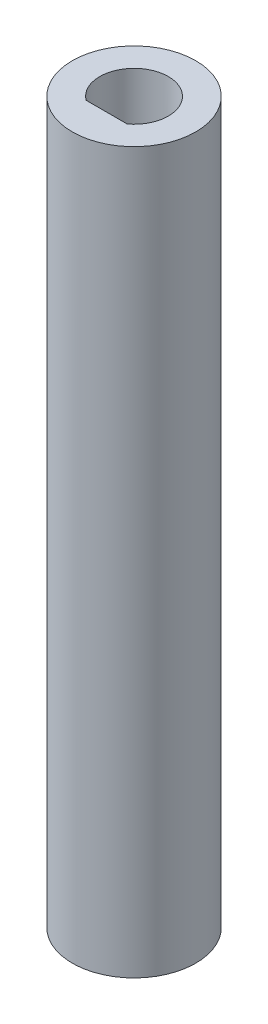
ISO-10303-21;
HEADER;
FILE_DESCRIPTION(('STEP AP214'),'2;1');
FILE_NAME('part.step','',(''),(''),'','','');
FILE_SCHEMA(('AUTOMOTIVE_DESIGN { 1 0 10303 214 1 1 1 1 }'));
ENDSEC;
DATA;
#1=APPLICATION_CONTEXT('core data for automotive mechanical design processes');
#2=APPLICATION_PROTOCOL_DEFINITION('international standard','automotive_design',2000,#1);
#3=PRODUCT_CONTEXT('',#1,'mechanical');
#4=PRODUCT('Part','Part','',(#3));
#5=PRODUCT_RELATED_PRODUCT_CATEGORY('part','',(#4));
#6=PRODUCT_DEFINITION_FORMATION('','',#4);
#7=PRODUCT_DEFINITION_CONTEXT('part definition',#1,'design');
#8=PRODUCT_DEFINITION('design','',#6,#7);
#9=PRODUCT_DEFINITION_SHAPE('','',#8);
#10=(LENGTH_UNIT() NAMED_UNIT(*) SI_UNIT(.MILLI.,.METRE.));
#11=(NAMED_UNIT(*) PLANE_ANGLE_UNIT() SI_UNIT($,.RADIAN.));
#12=(NAMED_UNIT(*) SI_UNIT($,.STERADIAN.) SOLID_ANGLE_UNIT());
#13=UNCERTAINTY_MEASURE_WITH_UNIT(LENGTH_MEASURE(1.E-05),#10,'distance_accuracy_value','');
#14=(GEOMETRIC_REPRESENTATION_CONTEXT(3) GLOBAL_UNCERTAINTY_ASSIGNED_CONTEXT((#13)) GLOBAL_UNIT_ASSIGNED_CONTEXT((#10,
#11,#12)) REPRESENTATION_CONTEXT('',''));
#15=CARTESIAN_POINT('',(0.,0.,0.));
#16=DIRECTION('',(0.,0.,1.));
#17=DIRECTION('',(1.,0.,0.));
#18=AXIS2_PLACEMENT_3D('',#15,#16,#17);
#19=CARTESIAN_POINT('',(0.,0.,0.));
#20=DIRECTION('',(0.,-1.,0.));
#21=DIRECTION('',(0.,0.,-1.));
#22=AXIS2_PLACEMENT_3D('',#19,#20,#21);
#23=PLANE('',#22);
#24=DIRECTION('',(-0.707106781186547,0.,0.707106781186548));
#25=VECTOR('',#24,1.);
#26=CARTESIAN_POINT('',(2.54000000000003,0.,0.));
#27=LINE('',#26,#25);
#28=CARTESIAN_POINT('',(3.12132722661339,0.,-0.581327226613362));
#29=VERTEX_POINT('',#28);
#30=CARTESIAN_POINT('',(2.54000000000003,0.,0.));
#31=VERTEX_POINT('',#30);
#32=EDGE_CURVE('E275',#29,#31,#27,.T.);
#33=ORIENTED_EDGE('',*,*,#32,.T.);
#34=DIRECTION('',(0.707106781186547,0.,0.707106781186548));
#35=VECTOR('',#34,1.);
#36=CARTESIAN_POINT('',(2.54000000000003,0.,0.));
#37=LINE('',#36,#35);
#38=CARTESIAN_POINT('',(3.12132722661339,0.,0.58132722661336));
#39=VERTEX_POINT('',#38);
#40=EDGE_CURVE('E268',#31,#39,#37,.T.);
#41=ORIENTED_EDGE('',*,*,#40,.T.);
#42=CARTESIAN_POINT('',(0.,0.,0.));
#43=DIRECTION('',(0.,1.,0.));
#44=DIRECTION('',(0.,0.,1.));
#45=AXIS2_PLACEMENT_3D('',#42,#43,#44);
#46=CIRCLE('',#45,3.175);
#47=EDGE_CURVE('E194',#39,#29,#46,.T.);
#48=ORIENTED_EDGE('',*,*,#47,.T.);
#49=EDGE_LOOP('',(#33,#41,#48));
#50=FACE_BOUND('',#49,.T.);
#51=ADVANCED_FACE('F32',(#50),#23,.F.);
#52=DIRECTION('',(0.707106781186547,0.,0.707106781186548));
#53=VECTOR('',#52,1.);
#54=CARTESIAN_POINT('',(0.,0.,-2.54));
#55=LINE('',#54,#53);
#56=CARTESIAN_POINT('',(-0.581327226613361,0.,-3.12132722661339));
#57=VERTEX_POINT('',#56);
#58=CARTESIAN_POINT('',(0.,0.,-2.54));
#59=VERTEX_POINT('',#58);
#60=EDGE_CURVE('E286',#57,#59,#55,.T.);
#61=ORIENTED_EDGE('',*,*,#60,.T.);
#62=DIRECTION('',(0.707106781186548,0.,-0.707106781186547));
#63=VECTOR('',#62,1.);
#64=CARTESIAN_POINT('',(0.,0.,-2.54));
#65=LINE('',#64,#63);
#66=CARTESIAN_POINT('',(0.581327226613404,0.,-3.12132722661338));
#67=VERTEX_POINT('',#66);
#68=EDGE_CURVE('E279',#59,#67,#65,.T.);
#69=ORIENTED_EDGE('',*,*,#68,.T.);
#70=EDGE_CURVE('E322',#67,#57,#46,.T.);
#71=ORIENTED_EDGE('',*,*,#70,.T.);
#72=EDGE_LOOP('',(#61,#69,#71));
#73=FACE_BOUND('',#72,.T.);
#74=ADVANCED_FACE('F353',(#73),#23,.F.);
#75=CARTESIAN_POINT('',(0.,12.7,0.));
#76=DIRECTION('',(0.,1.,0.));
#77=DIRECTION('',(0.,0.,1.));
#78=AXIS2_PLACEMENT_3D('',#75,#76,#77);
#79=PLANE('',#78);
#80=CARTESIAN_POINT('',(0.,12.7,0.));
#81=DIRECTION('',(0.,1.,0.));
#82=DIRECTION('',(0.,0.,1.));
#83=AXIS2_PLACEMENT_3D('',#80,#81,#82);
#84=CIRCLE('',#83,5.715);
#85=CARTESIAN_POINT('',(0.,12.7,5.715));
#86=VERTEX_POINT('',#85);
#87=EDGE_CURVE('E11',#86,#86,#84,.T.);
#88=ORIENTED_EDGE('',*,*,#87,.T.);
#89=EDGE_LOOP('',(#88));
#90=FACE_BOUND('',#89,.T.);
#91=DIRECTION('',(1.,0.,0.));
#92=VECTOR('',#91,1.);
#93=CARTESIAN_POINT('',(1.905,12.7,2.54));
#94=LINE('',#93,#92);
#95=CARTESIAN_POINT('',(-1.905,12.7,2.54));
#96=VERTEX_POINT('',#95);
#97=CARTESIAN_POINT('',(1.905,12.7,2.54));
#98=VERTEX_POINT('',#97);
#99=EDGE_CURVE('E198',#96,#98,#94,.T.);
#100=ORIENTED_EDGE('',*,*,#99,.F.);
#101=CARTESIAN_POINT('',(0.,12.7,0.));
#102=DIRECTION('',(0.,1.,0.));
#103=DIRECTION('',(0.,0.,1.));
#104=AXIS2_PLACEMENT_3D('',#101,#102,#103);
#105=CIRCLE('',#104,3.175);
#106=EDGE_CURVE('E164',#98,#96,#105,.T.);
#107=ORIENTED_EDGE('',*,*,#106,.F.);
#108=EDGE_LOOP('',(#100,#107));
#109=FACE_BOUND('',#108,.T.);
#110=ADVANCED_FACE('F208',(#90,#109),#79,.T.);
#111=CARTESIAN_POINT('',(0.,12.7,0.));
#112=DIRECTION('',(0.,-1.,0.));
#113=DIRECTION('',(0.,0.,-1.));
#114=AXIS2_PLACEMENT_3D('',#111,#112,#113);
#115=CYLINDRICAL_SURFACE('',#114,5.715);
#116=ORIENTED_EDGE('',*,*,#87,.F.);
#117=EDGE_LOOP('',(#116));
#118=FACE_BOUND('',#117,.T.);
#119=CARTESIAN_POINT('',(0.,-53.975,0.));
#120=DIRECTION('',(0.,-1.,0.));
#121=DIRECTION('',(0.,0.,-1.));
#122=AXIS2_PLACEMENT_3D('',#119,#120,#121);
#123=CIRCLE('',#122,5.715);
#124=CARTESIAN_POINT('',(0.,-53.975,-5.715));
#125=VERTEX_POINT('',#124);
#126=EDGE_CURVE('E211',#125,#125,#123,.T.);
#127=ORIENTED_EDGE('',*,*,#126,.F.);
#128=EDGE_LOOP('',(#127));
#129=FACE_BOUND('',#128,.T.);
#130=ADVANCED_FACE('F34',(#118,#129),#115,.T.);
#131=CARTESIAN_POINT('',(0.,12.7,0.));
#132=DIRECTION('',(0.,-1.,0.));
#133=DIRECTION('',(0.,0.,-1.));
#134=AXIS2_PLACEMENT_3D('',#131,#132,#133);
#135=CYLINDRICAL_SURFACE('',#134,3.175);
#136=CARTESIAN_POINT('',(1.905,0.,2.54));
#137=VERTEX_POINT('',#136);
#138=EDGE_CURVE('E193',#137,#39,#46,.T.);
#139=ORIENTED_EDGE('',*,*,#138,.F.);
#140=DIRECTION('',(0.,-1.,0.));
#141=VECTOR('',#140,1.);
#142=CARTESIAN_POINT('',(1.905,12.7,2.54));
#143=LINE('',#142,#141);
#144=EDGE_CURVE('E191',#98,#137,#143,.T.);
#145=ORIENTED_EDGE('',*,*,#144,.F.);
#146=ORIENTED_EDGE('',*,*,#106,.T.);
#147=DIRECTION('',(0.,-1.,0.));
#148=VECTOR('',#147,1.);
#149=CARTESIAN_POINT('',(-1.905,12.7,2.54));
#150=LINE('',#149,#148);
#151=CARTESIAN_POINT('',(-1.905,0.,2.54));
#152=VERTEX_POINT('',#151);
#153=EDGE_CURVE('E40',#96,#152,#150,.T.);
#154=ORIENTED_EDGE('',*,*,#153,.T.);
#155=CARTESIAN_POINT('',(-3.12132722661338,0.,0.581327226613404));
#156=VERTEX_POINT('',#155);
#157=EDGE_CURVE('E160',#156,#152,#46,.T.);
#158=ORIENTED_EDGE('',*,*,#157,.F.);
#159=CARTESIAN_POINT('',(-3.12132722661339,0.,-0.581327226613363));
#160=VERTEX_POINT('',#159);
#161=EDGE_CURVE('E298',#160,#156,#46,.T.);
#162=ORIENTED_EDGE('',*,*,#161,.F.);
#163=EDGE_CURVE('E319',#57,#160,#46,.T.);
#164=ORIENTED_EDGE('',*,*,#163,.F.);
#165=ORIENTED_EDGE('',*,*,#70,.F.);
#166=EDGE_CURVE('E323',#29,#67,#46,.T.);
#167=ORIENTED_EDGE('',*,*,#166,.F.);
#168=ORIENTED_EDGE('',*,*,#47,.F.);
#169=EDGE_LOOP('',(#139,#145,#146,#154,#158,#162,#164,#165,#167,#168));
#170=FACE_BOUND('',#169,.T.);
#171=ADVANCED_FACE('F201',(#170),#135,.F.);
#172=CARTESIAN_POINT('',(1.905,12.7,2.54));
#173=DIRECTION('',(0.,0.,-1.));
#174=DIRECTION('',(-1.,0.,0.));
#175=AXIS2_PLACEMENT_3D('',#172,#173,#174);
#176=PLANE('',#175);
#177=DIRECTION('',(1.,0.,0.));
#178=VECTOR('',#177,1.);
#179=CARTESIAN_POINT('',(1.905,0.,2.54));
#180=LINE('',#179,#178);
#181=CARTESIAN_POINT('',(0.,0.,2.5400000000001));
#182=VERTEX_POINT('',#181);
#183=EDGE_CURVE('E153',#152,#182,#180,.T.);
#184=ORIENTED_EDGE('',*,*,#183,.F.);
#185=ORIENTED_EDGE('',*,*,#153,.F.);
#186=ORIENTED_EDGE('',*,*,#99,.T.);
#187=ORIENTED_EDGE('',*,*,#144,.T.);
#188=EDGE_CURVE('E165',#182,#137,#180,.T.);
#189=ORIENTED_EDGE('',*,*,#188,.F.);
#190=EDGE_LOOP('',(#184,#185,#186,#187,#189));
#191=FACE_BOUND('',#190,.T.);
#192=ADVANCED_FACE('F189',(#191),#176,.T.);
#193=DIRECTION('',(0.707106781186547,0.,-0.707106781186548));
#194=VECTOR('',#193,1.);
#195=CARTESIAN_POINT('',(-2.54,0.,0.));
#196=LINE('',#195,#194);
#197=CARTESIAN_POINT('',(-2.54,0.,0.));
#198=VERTEX_POINT('',#197);
#199=EDGE_CURVE('E294',#156,#198,#196,.T.);
#200=ORIENTED_EDGE('',*,*,#199,.T.);
#201=DIRECTION('',(-0.707106781186547,0.,-0.707106781186548));
#202=VECTOR('',#201,1.);
#203=CARTESIAN_POINT('',(-2.54,0.,0.));
#204=LINE('',#203,#202);
#205=EDGE_CURVE('E47',#198,#160,#204,.T.);
#206=ORIENTED_EDGE('',*,*,#205,.T.);
#207=ORIENTED_EDGE('',*,*,#161,.T.);
#208=EDGE_LOOP('',(#200,#206,#207));
#209=FACE_BOUND('',#208,.T.);
#210=ADVANCED_FACE('F297',(#209),#23,.F.);
#211=CARTESIAN_POINT('',(0.,-53.975,0.));
#212=DIRECTION('',(0.,-1.,0.));
#213=DIRECTION('',(0.,0.,-1.));
#214=AXIS2_PLACEMENT_3D('',#211,#212,#213);
#215=PLANE('',#214);
#216=DIRECTION('',(-0.707106781186547,0.,-0.707106781186547));
#217=VECTOR('',#216,1.);
#218=CARTESIAN_POINT('',(0.,-53.975,2.5400000000001));
#219=LINE('',#218,#217);
#220=CARTESIAN_POINT('',(1.79605122421376,-53.975,4.33605122421393));
#221=VERTEX_POINT('',#220);
#222=CARTESIAN_POINT('',(0.,-53.975,2.5400000000001));
#223=VERTEX_POINT('',#222);
#224=EDGE_CURVE('E55',#221,#223,#219,.T.);
#225=ORIENTED_EDGE('',*,*,#224,.F.);
#226=DIRECTION('',(-0.707106781186548,0.,0.707106781186547));
#227=VECTOR('',#226,1.);
#228=CARTESIAN_POINT('',(1.79605122421376,-53.975,4.33605122421393));
#229=LINE('',#228,#227);
#230=CARTESIAN_POINT('',(4.33605122421386,-53.975,1.79605122421383));
#231=VERTEX_POINT('',#230);
#232=EDGE_CURVE('E187',#231,#221,#229,.T.);
#233=ORIENTED_EDGE('',*,*,#232,.F.);
#234=DIRECTION('',(0.707106781186547,0.,0.707106781186548));
#235=VECTOR('',#234,1.);
#236=CARTESIAN_POINT('',(2.54000000000003,-53.975,0.));
#237=LINE('',#236,#235);
#238=CARTESIAN_POINT('',(2.54000000000003,-53.975,0.));
#239=VERTEX_POINT('',#238);
#240=EDGE_CURVE('E237',#239,#231,#237,.T.);
#241=ORIENTED_EDGE('',*,*,#240,.F.);
#242=DIRECTION('',(-0.707106781186547,0.,0.707106781186548));
#243=VECTOR('',#242,1.);
#244=CARTESIAN_POINT('',(2.54000000000003,-53.975,0.));
#245=LINE('',#244,#243);
#246=CARTESIAN_POINT('',(4.33605122421383,-53.975,-1.7960512242138));
#247=VERTEX_POINT('',#246);
#248=EDGE_CURVE('E240',#247,#239,#245,.T.);
#249=ORIENTED_EDGE('',*,*,#248,.F.);
#250=DIRECTION('',(0.707106781186547,0.,0.707106781186547));
#251=VECTOR('',#250,1.);
#252=CARTESIAN_POINT('',(1.79605122421383,-53.975,-4.3360512242138));
#253=LINE('',#252,#251);
#254=CARTESIAN_POINT('',(1.79605122421383,-53.975,-4.3360512242138));
#255=VERTEX_POINT('',#254);
#256=EDGE_CURVE('E243',#255,#247,#253,.T.);
#257=ORIENTED_EDGE('',*,*,#256,.F.);
#258=DIRECTION('',(0.707106781186548,0.,-0.707106781186547));
#259=VECTOR('',#258,1.);
#260=CARTESIAN_POINT('',(0.,-53.975,-2.54));
#261=LINE('',#260,#259);
#262=CARTESIAN_POINT('',(0.,-53.975,-2.54));
#263=VERTEX_POINT('',#262);
#264=EDGE_CURVE('E246',#263,#255,#261,.T.);
#265=ORIENTED_EDGE('',*,*,#264,.F.);
#266=DIRECTION('',(0.707106781186547,0.,0.707106781186548));
#267=VECTOR('',#266,1.);
#268=CARTESIAN_POINT('',(0.,-53.975,-2.54));
#269=LINE('',#268,#267);
#270=CARTESIAN_POINT('',(-1.7960512242138,-53.975,-4.33605122421383));
#271=VERTEX_POINT('',#270);
#272=EDGE_CURVE('E249',#271,#263,#269,.T.);
#273=ORIENTED_EDGE('',*,*,#272,.F.);
#274=DIRECTION('',(0.707106781186548,0.,-0.707106781186547));
#275=VECTOR('',#274,1.);
#276=CARTESIAN_POINT('',(-4.33605122421383,-53.975,-1.79605122421381));
#277=LINE('',#276,#275);
#278=CARTESIAN_POINT('',(-4.33605122421383,-53.975,-1.79605122421381));
#279=VERTEX_POINT('',#278);
#280=EDGE_CURVE('E252',#279,#271,#277,.T.);
#281=ORIENTED_EDGE('',*,*,#280,.F.);
#282=DIRECTION('',(-0.707106781186547,0.,-0.707106781186548));
#283=VECTOR('',#282,1.);
#284=CARTESIAN_POINT('',(-2.54,-53.975,0.));
#285=LINE('',#284,#283);
#286=CARTESIAN_POINT('',(-2.54,-53.975,0.));
#287=VERTEX_POINT('',#286);
#288=EDGE_CURVE('E255',#287,#279,#285,.T.);
#289=ORIENTED_EDGE('',*,*,#288,.F.);
#290=DIRECTION('',(0.707106781186547,0.,-0.707106781186548));
#291=VECTOR('',#290,1.);
#292=CARTESIAN_POINT('',(-2.54,-53.975,0.));
#293=LINE('',#292,#291);
#294=CARTESIAN_POINT('',(-4.3360512242139,-53.975,1.79605122421393));
#295=VERTEX_POINT('',#294);
#296=EDGE_CURVE('E258',#295,#287,#293,.T.);
#297=ORIENTED_EDGE('',*,*,#296,.F.);
#298=DIRECTION('',(-0.707106781186547,0.,-0.707106781186547));
#299=VECTOR('',#298,1.);
#300=CARTESIAN_POINT('',(-4.3360512242139,-53.975,1.79605122421393));
#301=LINE('',#300,#299);
#302=CARTESIAN_POINT('',(-1.7960512242139,-53.975,4.33605122421393));
#303=VERTEX_POINT('',#302);
#304=EDGE_CURVE('E261',#303,#295,#301,.T.);
#305=ORIENTED_EDGE('',*,*,#304,.F.);
#306=DIRECTION('',(-0.707106781186548,0.,0.707106781186547));
#307=VECTOR('',#306,1.);
#308=CARTESIAN_POINT('',(0.,-53.975,2.5400000000001));
#309=LINE('',#308,#307);
#310=EDGE_CURVE('E264',#223,#303,#309,.T.);
#311=ORIENTED_EDGE('',*,*,#310,.F.);
#312=EDGE_LOOP('',(#225,#233,#241,#249,#257,#265,#273,#281,#289,#297,#305,#311));
#313=FACE_BOUND('',#312,.T.);
#314=ORIENTED_EDGE('',*,*,#126,.T.);
#315=EDGE_LOOP('',(#314));
#316=FACE_BOUND('',#315,.T.);
#317=ADVANCED_FACE('F310',(#313,#316),#215,.T.);
#318=CARTESIAN_POINT('',(0.,0.,0.));
#319=DIRECTION('',(0.,1.,0.));
#320=DIRECTION('',(0.,0.,1.));
#321=AXIS2_PLACEMENT_3D('',#318,#319,#320);
#322=PLANE('',#321);
#323=ORIENTED_EDGE('',*,*,#166,.T.);
#324=CARTESIAN_POINT('',(1.79605122421383,0.,-4.3360512242138));
#325=VERTEX_POINT('',#324);
#326=EDGE_CURVE('E282',#67,#325,#65,.T.);
#327=ORIENTED_EDGE('',*,*,#326,.T.);
#328=DIRECTION('',(0.707106781186547,0.,0.707106781186547));
#329=VECTOR('',#328,1.);
#330=CARTESIAN_POINT('',(1.79605122421383,0.,-4.3360512242138));
#331=LINE('',#330,#329);
#332=CARTESIAN_POINT('',(4.33605122421383,0.,-1.7960512242138));
#333=VERTEX_POINT('',#332);
#334=EDGE_CURVE('E276',#325,#333,#331,.T.);
#335=ORIENTED_EDGE('',*,*,#334,.T.);
#336=EDGE_CURVE('E272',#333,#29,#27,.T.);
#337=ORIENTED_EDGE('',*,*,#336,.T.);
#338=EDGE_LOOP('',(#323,#327,#335,#337));
#339=FACE_BOUND('',#338,.T.);
#340=ADVANCED_FACE('F365',(#339),#322,.F.);
#341=ORIENTED_EDGE('',*,*,#163,.T.);
#342=CARTESIAN_POINT('',(-4.33605122421383,0.,-1.79605122421381));
#343=VERTEX_POINT('',#342);
#344=EDGE_CURVE('E291',#160,#343,#204,.T.);
#345=ORIENTED_EDGE('',*,*,#344,.T.);
#346=DIRECTION('',(0.707106781186548,0.,-0.707106781186547));
#347=VECTOR('',#346,1.);
#348=CARTESIAN_POINT('',(-4.33605122421383,0.,-1.79605122421381));
#349=LINE('',#348,#347);
#350=CARTESIAN_POINT('',(-1.7960512242138,0.,-4.33605122421383));
#351=VERTEX_POINT('',#350);
#352=EDGE_CURVE('E287',#343,#351,#349,.T.);
#353=ORIENTED_EDGE('',*,*,#352,.T.);
#354=EDGE_CURVE('E283',#351,#57,#55,.T.);
#355=ORIENTED_EDGE('',*,*,#354,.T.);
#356=EDGE_LOOP('',(#341,#345,#353,#355));
#357=FACE_BOUND('',#356,.T.);
#358=ADVANCED_FACE('F317',(#357),#322,.F.);
#359=ORIENTED_EDGE('',*,*,#138,.T.);
#360=CARTESIAN_POINT('',(4.33605122421386,0.,1.79605122421383));
#361=VERTEX_POINT('',#360);
#362=EDGE_CURVE('E271',#39,#361,#37,.T.);
#363=ORIENTED_EDGE('',*,*,#362,.T.);
#364=DIRECTION('',(-0.707106781186548,0.,0.707106781186547));
#365=VECTOR('',#364,1.);
#366=CARTESIAN_POINT('',(1.79605122421376,0.,4.33605122421393));
#367=LINE('',#366,#365);
#368=CARTESIAN_POINT('',(1.79605122421376,0.,4.33605122421393));
#369=VERTEX_POINT('',#368);
#370=EDGE_CURVE('E177',#361,#369,#367,.T.);
#371=ORIENTED_EDGE('',*,*,#370,.T.);
#372=DIRECTION('',(-0.707106781186547,0.,-0.707106781186547));
#373=VECTOR('',#372,1.);
#374=CARTESIAN_POINT('',(0.,0.,2.5400000000001));
#375=LINE('',#374,#373);
#376=EDGE_CURVE('E171',#369,#182,#375,.T.);
#377=ORIENTED_EDGE('',*,*,#376,.T.);
#378=ORIENTED_EDGE('',*,*,#188,.T.);
#379=EDGE_LOOP('',(#359,#363,#371,#377,#378));
#380=FACE_BOUND('',#379,.T.);
#381=ADVANCED_FACE('F184',(#380),#322,.F.);
#382=CARTESIAN_POINT('',(0.,0.,2.5400000000001));
#383=DIRECTION('',(-0.707106781186547,0.,0.707106781186547));
#384=DIRECTION('',(0.707106781186548,0.,0.707106781186548));
#385=AXIS2_PLACEMENT_3D('',#382,#383,#384);
#386=PLANE('',#385);
#387=ORIENTED_EDGE('',*,*,#224,.T.);
#388=DIRECTION('',(0.,-1.,0.));
#389=VECTOR('',#388,1.);
#390=CARTESIAN_POINT('',(0.,0.,2.5400000000001));
#391=LINE('',#390,#389);
#392=EDGE_CURVE('E168',#182,#223,#391,.T.);
#393=ORIENTED_EDGE('',*,*,#392,.F.);
#394=ORIENTED_EDGE('',*,*,#376,.F.);
#395=DIRECTION('',(0.,-1.,0.));
#396=VECTOR('',#395,1.);
#397=CARTESIAN_POINT('',(1.79605122421376,0.,4.33605122421393));
#398=LINE('',#397,#396);
#399=EDGE_CURVE('E213',#369,#221,#398,.T.);
#400=ORIENTED_EDGE('',*,*,#399,.T.);
#401=EDGE_LOOP('',(#387,#393,#394,#400));
#402=FACE_BOUND('',#401,.T.);
#403=ADVANCED_FACE('F169',(#402),#386,.F.);
#404=CARTESIAN_POINT('',(1.79605122421376,0.,4.33605122421393));
#405=DIRECTION('',(0.707106781186547,0.,0.707106781186548));
#406=DIRECTION('',(0.707106781186548,0.,-0.707106781186547));
#407=AXIS2_PLACEMENT_3D('',#404,#405,#406);
#408=PLANE('',#407);
#409=ORIENTED_EDGE('',*,*,#232,.T.);
#410=ORIENTED_EDGE('',*,*,#399,.F.);
#411=ORIENTED_EDGE('',*,*,#370,.F.);
#412=DIRECTION('',(0.,-1.,0.));
#413=VECTOR('',#412,1.);
#414=CARTESIAN_POINT('',(4.33605122421386,0.,1.79605122421383));
#415=LINE('',#414,#413);
#416=EDGE_CURVE('E232',#361,#231,#415,.T.);
#417=ORIENTED_EDGE('',*,*,#416,.T.);
#418=EDGE_LOOP('',(#409,#410,#411,#417));
#419=FACE_BOUND('',#418,.T.);
#420=ADVANCED_FACE('F340',(#419),#408,.F.);
#421=CARTESIAN_POINT('',(2.54000000000003,0.,0.));
#422=DIRECTION('',(0.707106781186548,0.,-0.707106781186547));
#423=DIRECTION('',(-0.707106781186547,0.,-0.707106781186548));
#424=AXIS2_PLACEMENT_3D('',#421,#422,#423);
#425=PLANE('',#424);
#426=ORIENTED_EDGE('',*,*,#240,.T.);
#427=ORIENTED_EDGE('',*,*,#416,.F.);
#428=ORIENTED_EDGE('',*,*,#362,.F.);
#429=ORIENTED_EDGE('',*,*,#40,.F.);
#430=DIRECTION('',(0.,-1.,0.));
#431=VECTOR('',#430,1.);
#432=CARTESIAN_POINT('',(2.54000000000003,0.,0.));
#433=LINE('',#432,#431);
#434=EDGE_CURVE('E230',#31,#239,#433,.T.);
#435=ORIENTED_EDGE('',*,*,#434,.T.);
#436=EDGE_LOOP('',(#426,#427,#428,#429,#435));
#437=FACE_BOUND('',#436,.T.);
#438=ADVANCED_FACE('F335',(#437),#425,.F.);
#439=CARTESIAN_POINT('',(2.54000000000003,0.,0.));
#440=DIRECTION('',(0.707106781186548,0.,0.707106781186547));
#441=DIRECTION('',(0.707106781186547,0.,-0.707106781186548));
#442=AXIS2_PLACEMENT_3D('',#439,#440,#441);
#443=PLANE('',#442);
#444=ORIENTED_EDGE('',*,*,#248,.T.);
#445=ORIENTED_EDGE('',*,*,#434,.F.);
#446=ORIENTED_EDGE('',*,*,#32,.F.);
#447=ORIENTED_EDGE('',*,*,#336,.F.);
#448=DIRECTION('',(0.,-1.,0.));
#449=VECTOR('',#448,1.);
#450=CARTESIAN_POINT('',(4.33605122421383,0.,-1.7960512242138));
#451=LINE('',#450,#449);
#452=EDGE_CURVE('E228',#333,#247,#451,.T.);
#453=ORIENTED_EDGE('',*,*,#452,.T.);
#454=EDGE_LOOP('',(#444,#445,#446,#447,#453));
#455=FACE_BOUND('',#454,.T.);
#456=ADVANCED_FACE('F451',(#455),#443,.F.);
#457=CARTESIAN_POINT('',(1.79605122421383,0.,-4.3360512242138));
#458=DIRECTION('',(0.707106781186547,0.,-0.707106781186547));
#459=DIRECTION('',(-0.707106781186548,0.,-0.707106781186548));
#460=AXIS2_PLACEMENT_3D('',#457,#458,#459);
#461=PLANE('',#460);
#462=ORIENTED_EDGE('',*,*,#256,.T.);
#463=ORIENTED_EDGE('',*,*,#452,.F.);
#464=ORIENTED_EDGE('',*,*,#334,.F.);
#465=DIRECTION('',(0.,-1.,0.));
#466=VECTOR('',#465,1.);
#467=CARTESIAN_POINT('',(1.79605122421383,0.,-4.3360512242138));
#468=LINE('',#467,#466);
#469=EDGE_CURVE('E226',#325,#255,#468,.T.);
#470=ORIENTED_EDGE('',*,*,#469,.T.);
#471=EDGE_LOOP('',(#462,#463,#464,#470));
#472=FACE_BOUND('',#471,.T.);
#473=ADVANCED_FACE('F460',(#472),#461,.F.);
#474=CARTESIAN_POINT('',(0.,0.,-2.54));
#475=DIRECTION('',(-0.707106781186547,0.,-0.707106781186548));
#476=DIRECTION('',(-0.707106781186548,0.,0.707106781186547));
#477=AXIS2_PLACEMENT_3D('',#474,#475,#476);
#478=PLANE('',#477);
#479=ORIENTED_EDGE('',*,*,#264,.T.);
#480=ORIENTED_EDGE('',*,*,#469,.F.);
#481=ORIENTED_EDGE('',*,*,#326,.F.);
#482=ORIENTED_EDGE('',*,*,#68,.F.);
#483=DIRECTION('',(0.,-1.,0.));
#484=VECTOR('',#483,1.);
#485=CARTESIAN_POINT('',(0.,0.,-2.54));
#486=LINE('',#485,#484);
#487=EDGE_CURVE('E224',#59,#263,#486,.T.);
#488=ORIENTED_EDGE('',*,*,#487,.T.);
#489=EDGE_LOOP('',(#479,#480,#481,#482,#488));
#490=FACE_BOUND('',#489,.T.);
#491=ADVANCED_FACE('F470',(#490),#478,.F.);
#492=CARTESIAN_POINT('',(0.,0.,-2.54));
#493=DIRECTION('',(0.707106781186548,0.,-0.707106781186547));
#494=DIRECTION('',(-0.707106781186547,0.,-0.707106781186548));
#495=AXIS2_PLACEMENT_3D('',#492,#493,#494);
#496=PLANE('',#495);
#497=ORIENTED_EDGE('',*,*,#272,.T.);
#498=ORIENTED_EDGE('',*,*,#487,.F.);
#499=ORIENTED_EDGE('',*,*,#60,.F.);
#500=ORIENTED_EDGE('',*,*,#354,.F.);
#501=DIRECTION('',(0.,-1.,0.));
#502=VECTOR('',#501,1.);
#503=CARTESIAN_POINT('',(-1.7960512242138,0.,-4.33605122421383));
#504=LINE('',#503,#502);
#505=EDGE_CURVE('E222',#351,#271,#504,.T.);
#506=ORIENTED_EDGE('',*,*,#505,.T.);
#507=EDGE_LOOP('',(#497,#498,#499,#500,#506));
#508=FACE_BOUND('',#507,.T.);
#509=ADVANCED_FACE('F480',(#508),#496,.F.);
#510=CARTESIAN_POINT('',(-4.33605122421383,0.,-1.79605122421381));
#511=DIRECTION('',(-0.707106781186547,0.,-0.707106781186548));
#512=DIRECTION('',(-0.707106781186548,0.,0.707106781186547));
#513=AXIS2_PLACEMENT_3D('',#510,#511,#512);
#514=PLANE('',#513);
#515=ORIENTED_EDGE('',*,*,#280,.T.);
#516=ORIENTED_EDGE('',*,*,#505,.F.);
#517=ORIENTED_EDGE('',*,*,#352,.F.);
#518=DIRECTION('',(0.,-1.,0.));
#519=VECTOR('',#518,1.);
#520=CARTESIAN_POINT('',(-4.33605122421383,0.,-1.79605122421381));
#521=LINE('',#520,#519);
#522=EDGE_CURVE('E220',#343,#279,#521,.T.);
#523=ORIENTED_EDGE('',*,*,#522,.T.);
#524=EDGE_LOOP('',(#515,#516,#517,#523));
#525=FACE_BOUND('',#524,.T.);
#526=ADVANCED_FACE('F314',(#525),#514,.F.);
#527=CARTESIAN_POINT('',(-2.54,0.,0.));
#528=DIRECTION('',(-0.707106781186548,0.,0.707106781186547));
#529=DIRECTION('',(0.707106781186547,0.,0.707106781186548));
#530=AXIS2_PLACEMENT_3D('',#527,#528,#529);
#531=PLANE('',#530);
#532=ORIENTED_EDGE('',*,*,#288,.T.);
#533=ORIENTED_EDGE('',*,*,#522,.F.);
#534=ORIENTED_EDGE('',*,*,#344,.F.);
#535=ORIENTED_EDGE('',*,*,#205,.F.);
#536=DIRECTION('',(0.,-1.,0.));
#537=VECTOR('',#536,1.);
#538=CARTESIAN_POINT('',(-2.54,0.,0.));
#539=LINE('',#538,#537);
#540=EDGE_CURVE('E218',#198,#287,#539,.T.);
#541=ORIENTED_EDGE('',*,*,#540,.T.);
#542=EDGE_LOOP('',(#532,#533,#534,#535,#541));
#543=FACE_BOUND('',#542,.T.);
#544=ADVANCED_FACE('F304',(#543),#531,.F.);
#545=CARTESIAN_POINT('',(-2.54,0.,0.));
#546=DIRECTION('',(-0.707106781186548,0.,-0.707106781186547));
#547=DIRECTION('',(-0.707106781186547,0.,0.707106781186548));
#548=AXIS2_PLACEMENT_3D('',#545,#546,#547);
#549=PLANE('',#548);
#550=ORIENTED_EDGE('',*,*,#296,.T.);
#551=ORIENTED_EDGE('',*,*,#540,.F.);
#552=ORIENTED_EDGE('',*,*,#199,.F.);
#553=CARTESIAN_POINT('',(-4.3360512242139,0.,1.79605122421393));
#554=VERTEX_POINT('',#553);
#555=EDGE_CURVE('E292',#554,#156,#196,.T.);
#556=ORIENTED_EDGE('',*,*,#555,.F.);
#557=DIRECTION('',(0.,-1.,0.));
#558=VECTOR('',#557,1.);
#559=CARTESIAN_POINT('',(-4.3360512242139,0.,1.79605122421393));
#560=LINE('',#559,#558);
#561=EDGE_CURVE('E216',#554,#295,#560,.T.);
#562=ORIENTED_EDGE('',*,*,#561,.T.);
#563=EDGE_LOOP('',(#550,#551,#552,#556,#562));
#564=FACE_BOUND('',#563,.T.);
#565=ADVANCED_FACE('F301',(#564),#549,.F.);
#566=CARTESIAN_POINT('',(-4.3360512242139,0.,1.79605122421393));
#567=DIRECTION('',(-0.707106781186547,0.,0.707106781186547));
#568=DIRECTION('',(0.707106781186548,0.,0.707106781186548));
#569=AXIS2_PLACEMENT_3D('',#566,#567,#568);
#570=PLANE('',#569);
#571=ORIENTED_EDGE('',*,*,#304,.T.);
#572=ORIENTED_EDGE('',*,*,#561,.F.);
#573=DIRECTION('',(-0.707106781186547,0.,-0.707106781186547));
#574=VECTOR('',#573,1.);
#575=CARTESIAN_POINT('',(-4.3360512242139,0.,1.79605122421393));
#576=LINE('',#575,#574);
#577=CARTESIAN_POINT('',(-1.7960512242139,0.,4.33605122421393));
#578=VERTEX_POINT('',#577);
#579=EDGE_CURVE('E181',#578,#554,#576,.T.);
#580=ORIENTED_EDGE('',*,*,#579,.F.);
#581=DIRECTION('',(0.,-1.,0.));
#582=VECTOR('',#581,1.);
#583=CARTESIAN_POINT('',(-1.7960512242139,0.,4.33605122421393));
#584=LINE('',#583,#582);
#585=EDGE_CURVE('E176',#578,#303,#584,.T.);
#586=ORIENTED_EDGE('',*,*,#585,.T.);
#587=EDGE_LOOP('',(#571,#572,#580,#586));
#588=FACE_BOUND('',#587,.T.);
#589=ADVANCED_FACE('F343',(#588),#570,.F.);
#590=CARTESIAN_POINT('',(0.,0.,2.5400000000001));
#591=DIRECTION('',(0.707106781186547,0.,0.707106781186548));
#592=DIRECTION('',(0.707106781186548,0.,-0.707106781186547));
#593=AXIS2_PLACEMENT_3D('',#590,#591,#592);
#594=PLANE('',#593);
#595=ORIENTED_EDGE('',*,*,#310,.T.);
#596=ORIENTED_EDGE('',*,*,#585,.F.);
#597=DIRECTION('',(-0.707106781186548,0.,0.707106781186547));
#598=VECTOR('',#597,1.);
#599=CARTESIAN_POINT('',(0.,0.,2.5400000000001));
#600=LINE('',#599,#598);
#601=EDGE_CURVE('E157',#182,#578,#600,.T.);
#602=ORIENTED_EDGE('',*,*,#601,.F.);
#603=ORIENTED_EDGE('',*,*,#392,.T.);
#604=EDGE_LOOP('',(#595,#596,#602,#603));
#605=FACE_BOUND('',#604,.T.);
#606=ADVANCED_FACE('F179',(#605),#594,.F.);
#607=ORIENTED_EDGE('',*,*,#183,.T.);
#608=ORIENTED_EDGE('',*,*,#601,.T.);
#609=ORIENTED_EDGE('',*,*,#579,.T.);
#610=ORIENTED_EDGE('',*,*,#555,.T.);
#611=ORIENTED_EDGE('',*,*,#157,.T.);
#612=EDGE_LOOP('',(#607,#608,#609,#610,#611));
#613=FACE_BOUND('',#612,.T.);
#614=ADVANCED_FACE('F154',(#613),#322,.F.);
#615=CLOSED_SHELL('',(#51,#74,#110,#130,#171,#192,#210,#317,#340,#358,#381,#403,#420,#438,#456,
#473,#491,#509,#526,#544,#565,#589,#606,#614));
#616=MANIFOLD_SOLID_BREP('B2',#615);
#617=ADVANCED_BREP_SHAPE_REPRESENTATION('',(#18,#616),#14);
#618=SHAPE_DEFINITION_REPRESENTATION(#9,#617);
ENDSEC;
END-ISO-10303-21;
